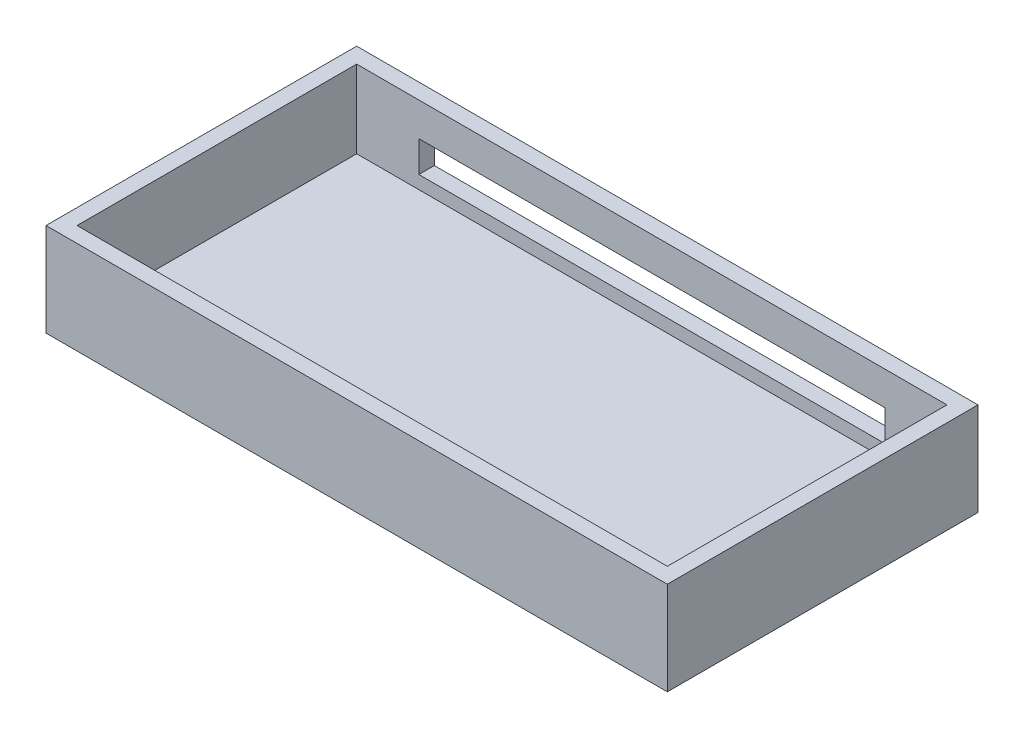
ISO-10303-21;
HEADER;
FILE_DESCRIPTION(('STEP AP214'),'2;1');
FILE_NAME('part.step','',(''),(''),'','','');
FILE_SCHEMA(('AUTOMOTIVE_DESIGN { 1 0 10303 214 1 1 1 1 }'));
ENDSEC;
DATA;
#1=APPLICATION_CONTEXT('core data for automotive mechanical design processes');
#2=APPLICATION_PROTOCOL_DEFINITION('international standard','automotive_design',2000,#1);
#3=PRODUCT_CONTEXT('',#1,'mechanical');
#4=PRODUCT('Part','Part','',(#3));
#5=PRODUCT_RELATED_PRODUCT_CATEGORY('part','',(#4));
#6=PRODUCT_DEFINITION_FORMATION('','',#4);
#7=PRODUCT_DEFINITION_CONTEXT('part definition',#1,'design');
#8=PRODUCT_DEFINITION('design','',#6,#7);
#9=PRODUCT_DEFINITION_SHAPE('','',#8);
#10=(LENGTH_UNIT() NAMED_UNIT(*) SI_UNIT(.MILLI.,.METRE.));
#11=(NAMED_UNIT(*) PLANE_ANGLE_UNIT() SI_UNIT($,.RADIAN.));
#12=(NAMED_UNIT(*) SI_UNIT($,.STERADIAN.) SOLID_ANGLE_UNIT());
#13=UNCERTAINTY_MEASURE_WITH_UNIT(LENGTH_MEASURE(1.E-05),#10,'distance_accuracy_value','');
#14=(GEOMETRIC_REPRESENTATION_CONTEXT(3) GLOBAL_UNCERTAINTY_ASSIGNED_CONTEXT((#13)) GLOBAL_UNIT_ASSIGNED_CONTEXT((#10,
#11,#12)) REPRESENTATION_CONTEXT('',''));
#15=CARTESIAN_POINT('',(0.,0.,0.));
#16=DIRECTION('',(0.,0.,1.));
#17=DIRECTION('',(1.,0.,0.));
#18=AXIS2_PLACEMENT_3D('',#15,#16,#17);
#19=CARTESIAN_POINT('',(100.,30.,-50.));
#20=DIRECTION('',(-1.,0.,0.));
#21=DIRECTION('',(0.,0.,1.));
#22=AXIS2_PLACEMENT_3D('',#19,#20,#21);
#23=PLANE('',#22);
#24=DIRECTION('',(0.,0.,-1.));
#25=VECTOR('',#24,1.);
#26=CARTESIAN_POINT('',(100.,0.,-50.));
#27=LINE('',#26,#25);
#28=CARTESIAN_POINT('',(100.,0.,50.));
#29=VERTEX_POINT('',#28);
#30=CARTESIAN_POINT('',(100.,0.,-50.));
#31=VERTEX_POINT('',#30);
#32=EDGE_CURVE('E169',#29,#31,#27,.T.);
#33=ORIENTED_EDGE('',*,*,#32,.T.);
#34=DIRECTION('',(0.,-1.,0.));
#35=VECTOR('',#34,1.);
#36=CARTESIAN_POINT('',(100.,30.,-50.));
#37=LINE('',#36,#35);
#38=CARTESIAN_POINT('',(100.,30.,-50.));
#39=VERTEX_POINT('',#38);
#40=EDGE_CURVE('E11',#39,#31,#37,.T.);
#41=ORIENTED_EDGE('',*,*,#40,.F.);
#42=DIRECTION('',(0.,0.,-1.));
#43=VECTOR('',#42,1.);
#44=CARTESIAN_POINT('',(100.,30.,-50.));
#45=LINE('',#44,#43);
#46=CARTESIAN_POINT('',(100.,30.,50.));
#47=VERTEX_POINT('',#46);
#48=EDGE_CURVE('E193',#47,#39,#45,.T.);
#49=ORIENTED_EDGE('',*,*,#48,.F.);
#50=DIRECTION('',(0.,-1.,0.));
#51=VECTOR('',#50,1.);
#52=CARTESIAN_POINT('',(100.,30.,50.));
#53=LINE('',#52,#51);
#54=EDGE_CURVE('E203',#47,#29,#53,.T.);
#55=ORIENTED_EDGE('',*,*,#54,.T.);
#56=EDGE_LOOP('',(#33,#41,#49,#55));
#57=FACE_BOUND('',#56,.T.);
#58=ADVANCED_FACE('F37',(#57),#23,.F.);
#59=CARTESIAN_POINT('',(-100.,30.,-50.));
#60=DIRECTION('',(0.,0.,1.));
#61=DIRECTION('',(1.,0.,0.));
#62=AXIS2_PLACEMENT_3D('',#59,#60,#61);
#63=PLANE('',#62);
#64=DIRECTION('',(1.,0.,0.));
#65=VECTOR('',#64,1.);
#66=CARTESIAN_POINT('',(-100.,9.22357402838771,-50.));
#67=LINE('',#66,#65);
#68=CARTESIAN_POINT('',(-75.,9.22357402838771,-50.));
#69=VERTEX_POINT('',#68);
#70=CARTESIAN_POINT('',(75.,9.22357402838771,-50.));
#71=VERTEX_POINT('',#70);
#72=EDGE_CURVE('E156',#69,#71,#67,.T.);
#73=ORIENTED_EDGE('',*,*,#72,.T.);
#74=DIRECTION('',(0.,1.,0.));
#75=VECTOR('',#74,1.);
#76=CARTESIAN_POINT('',(75.,30.,-50.));
#77=LINE('',#76,#75);
#78=CARTESIAN_POINT('',(75.,19.2235740283877,-50.));
#79=VERTEX_POINT('',#78);
#80=EDGE_CURVE('E159',#71,#79,#77,.T.);
#81=ORIENTED_EDGE('',*,*,#80,.T.);
#82=DIRECTION('',(-1.,0.,0.));
#83=VECTOR('',#82,1.);
#84=CARTESIAN_POINT('',(-100.,19.2235740283877,-50.));
#85=LINE('',#84,#83);
#86=CARTESIAN_POINT('',(-75.,19.2235740283877,-50.));
#87=VERTEX_POINT('',#86);
#88=EDGE_CURVE('E151',#79,#87,#85,.T.);
#89=ORIENTED_EDGE('',*,*,#88,.T.);
#90=DIRECTION('',(0.,-1.,0.));
#91=VECTOR('',#90,1.);
#92=CARTESIAN_POINT('',(-75.0000000000001,30.,-50.));
#93=LINE('',#92,#91);
#94=EDGE_CURVE('E131',#87,#69,#93,.T.);
#95=ORIENTED_EDGE('',*,*,#94,.T.);
#96=EDGE_LOOP('',(#73,#81,#89,#95));
#97=FACE_BOUND('',#96,.T.);
#98=DIRECTION('',(-1.,0.,0.));
#99=VECTOR('',#98,1.);
#100=CARTESIAN_POINT('',(-100.,0.,-50.));
#101=LINE('',#100,#99);
#102=CARTESIAN_POINT('',(-100.,0.,-50.));
#103=VERTEX_POINT('',#102);
#104=EDGE_CURVE('E206',#31,#103,#101,.T.);
#105=ORIENTED_EDGE('',*,*,#104,.T.);
#106=DIRECTION('',(0.,-1.,0.));
#107=VECTOR('',#106,1.);
#108=CARTESIAN_POINT('',(-100.,30.,-50.));
#109=LINE('',#108,#107);
#110=CARTESIAN_POINT('',(-100.,30.,-50.));
#111=VERTEX_POINT('',#110);
#112=EDGE_CURVE('E44',#111,#103,#109,.T.);
#113=ORIENTED_EDGE('',*,*,#112,.F.);
#114=DIRECTION('',(-1.,0.,0.));
#115=VECTOR('',#114,1.);
#116=CARTESIAN_POINT('',(-100.,30.,-50.));
#117=LINE('',#116,#115);
#118=EDGE_CURVE('E196',#39,#111,#117,.T.);
#119=ORIENTED_EDGE('',*,*,#118,.F.);
#120=ORIENTED_EDGE('',*,*,#40,.T.);
#121=EDGE_LOOP('',(#105,#113,#119,#120));
#122=FACE_BOUND('',#121,.T.);
#123=ADVANCED_FACE('F236',(#97,#122),#63,.F.);
#124=CARTESIAN_POINT('',(-100.,30.,-50.));
#125=DIRECTION('',(1.,0.,0.));
#126=DIRECTION('',(0.,0.,-1.));
#127=AXIS2_PLACEMENT_3D('',#124,#125,#126);
#128=PLANE('',#127);
#129=DIRECTION('',(0.,0.,1.));
#130=VECTOR('',#129,1.);
#131=CARTESIAN_POINT('',(-100.,0.,-50.));
#132=LINE('',#131,#130);
#133=CARTESIAN_POINT('',(-100.,0.,50.));
#134=VERTEX_POINT('',#133);
#135=EDGE_CURVE('E208',#103,#134,#132,.T.);
#136=ORIENTED_EDGE('',*,*,#135,.T.);
#137=DIRECTION('',(0.,-1.,0.));
#138=VECTOR('',#137,1.);
#139=CARTESIAN_POINT('',(-100.,30.,50.));
#140=LINE('',#139,#138);
#141=CARTESIAN_POINT('',(-100.,30.,50.));
#142=VERTEX_POINT('',#141);
#143=EDGE_CURVE('E213',#142,#134,#140,.T.);
#144=ORIENTED_EDGE('',*,*,#143,.F.);
#145=DIRECTION('',(0.,0.,1.));
#146=VECTOR('',#145,1.);
#147=CARTESIAN_POINT('',(-100.,30.,-50.));
#148=LINE('',#147,#146);
#149=EDGE_CURVE('E199',#111,#142,#148,.T.);
#150=ORIENTED_EDGE('',*,*,#149,.F.);
#151=ORIENTED_EDGE('',*,*,#112,.T.);
#152=EDGE_LOOP('',(#136,#144,#150,#151));
#153=FACE_BOUND('',#152,.T.);
#154=ADVANCED_FACE('F220',(#153),#128,.F.);
#155=CARTESIAN_POINT('',(-100.,30.,50.));
#156=DIRECTION('',(0.,0.,-1.));
#157=DIRECTION('',(-1.,0.,0.));
#158=AXIS2_PLACEMENT_3D('',#155,#156,#157);
#159=PLANE('',#158);
#160=DIRECTION('',(1.,0.,0.));
#161=VECTOR('',#160,1.);
#162=CARTESIAN_POINT('',(-100.,0.,50.));
#163=LINE('',#162,#161);
#164=EDGE_CURVE('E197',#134,#29,#163,.T.);
#165=ORIENTED_EDGE('',*,*,#164,.T.);
#166=ORIENTED_EDGE('',*,*,#54,.F.);
#167=DIRECTION('',(1.,0.,0.));
#168=VECTOR('',#167,1.);
#169=CARTESIAN_POINT('',(-100.,30.,50.));
#170=LINE('',#169,#168);
#171=EDGE_CURVE('E201',#142,#47,#170,.T.);
#172=ORIENTED_EDGE('',*,*,#171,.F.);
#173=ORIENTED_EDGE('',*,*,#143,.T.);
#174=EDGE_LOOP('',(#165,#166,#172,#173));
#175=FACE_BOUND('',#174,.T.);
#176=ADVANCED_FACE('F229',(#175),#159,.F.);
#177=CARTESIAN_POINT('',(0.,30.,0.));
#178=DIRECTION('',(0.,1.,0.));
#179=DIRECTION('',(0.,0.,1.));
#180=AXIS2_PLACEMENT_3D('',#177,#178,#179);
#181=PLANE('',#180);
#182=DIRECTION('',(0.,0.,-1.));
#183=VECTOR('',#182,1.);
#184=CARTESIAN_POINT('',(95.,30.,-50.));
#185=LINE('',#184,#183);
#186=CARTESIAN_POINT('',(95.,30.,45.));
#187=VERTEX_POINT('',#186);
#188=CARTESIAN_POINT('',(95.,30.,-45.));
#189=VERTEX_POINT('',#188);
#190=EDGE_CURVE('E185',#187,#189,#185,.T.);
#191=ORIENTED_EDGE('',*,*,#190,.F.);
#192=DIRECTION('',(1.,0.,0.));
#193=VECTOR('',#192,1.);
#194=CARTESIAN_POINT('',(-100.,30.,45.));
#195=LINE('',#194,#193);
#196=CARTESIAN_POINT('',(-95.,30.,45.));
#197=VERTEX_POINT('',#196);
#198=EDGE_CURVE('E175',#197,#187,#195,.T.);
#199=ORIENTED_EDGE('',*,*,#198,.F.);
#200=DIRECTION('',(0.,0.,1.));
#201=VECTOR('',#200,1.);
#202=CARTESIAN_POINT('',(-95.,30.,-50.));
#203=LINE('',#202,#201);
#204=CARTESIAN_POINT('',(-95.,30.,-45.));
#205=VERTEX_POINT('',#204);
#206=EDGE_CURVE('E189',#205,#197,#203,.T.);
#207=ORIENTED_EDGE('',*,*,#206,.F.);
#208=DIRECTION('',(-1.,0.,0.));
#209=VECTOR('',#208,1.);
#210=CARTESIAN_POINT('',(-100.,30.,-45.));
#211=LINE('',#210,#209);
#212=EDGE_CURVE('E187',#189,#205,#211,.T.);
#213=ORIENTED_EDGE('',*,*,#212,.F.);
#214=EDGE_LOOP('',(#191,#199,#207,#213));
#215=FACE_BOUND('',#214,.T.);
#216=ORIENTED_EDGE('',*,*,#48,.T.);
#217=ORIENTED_EDGE('',*,*,#118,.T.);
#218=ORIENTED_EDGE('',*,*,#149,.T.);
#219=ORIENTED_EDGE('',*,*,#171,.T.);
#220=EDGE_LOOP('',(#216,#217,#218,#219));
#221=FACE_BOUND('',#220,.T.);
#222=ADVANCED_FACE('F235',(#215,#221),#181,.T.);
#223=CARTESIAN_POINT('',(0.,0.,0.));
#224=DIRECTION('',(0.,1.,0.));
#225=DIRECTION('',(0.,0.,1.));
#226=AXIS2_PLACEMENT_3D('',#223,#224,#225);
#227=PLANE('',#226);
#228=ORIENTED_EDGE('',*,*,#32,.F.);
#229=ORIENTED_EDGE('',*,*,#164,.F.);
#230=ORIENTED_EDGE('',*,*,#135,.F.);
#231=ORIENTED_EDGE('',*,*,#104,.F.);
#232=EDGE_LOOP('',(#228,#229,#230,#231));
#233=FACE_BOUND('',#232,.T.);
#234=ADVANCED_FACE('F226',(#233),#227,.F.);
#235=CARTESIAN_POINT('',(95.,30.,-50.));
#236=DIRECTION('',(-1.,0.,0.));
#237=DIRECTION('',(0.,0.,1.));
#238=AXIS2_PLACEMENT_3D('',#235,#236,#237);
#239=PLANE('',#238);
#240=DIRECTION('',(0.,0.,-1.));
#241=VECTOR('',#240,1.);
#242=CARTESIAN_POINT('',(95.,5.,-50.));
#243=LINE('',#242,#241);
#244=CARTESIAN_POINT('',(95.,5.,45.));
#245=VERTEX_POINT('',#244);
#246=CARTESIAN_POINT('',(95.,5.,-45.));
#247=VERTEX_POINT('',#246);
#248=EDGE_CURVE('E162',#245,#247,#243,.T.);
#249=ORIENTED_EDGE('',*,*,#248,.F.);
#250=DIRECTION('',(0.,-1.,0.));
#251=VECTOR('',#250,1.);
#252=CARTESIAN_POINT('',(95.,30.,45.));
#253=LINE('',#252,#251);
#254=EDGE_CURVE('E171',#187,#245,#253,.T.);
#255=ORIENTED_EDGE('',*,*,#254,.F.);
#256=ORIENTED_EDGE('',*,*,#190,.T.);
#257=DIRECTION('',(0.,-1.,0.));
#258=VECTOR('',#257,1.);
#259=CARTESIAN_POINT('',(95.,30.,-45.));
#260=LINE('',#259,#258);
#261=EDGE_CURVE('E166',#189,#247,#260,.T.);
#262=ORIENTED_EDGE('',*,*,#261,.T.);
#263=EDGE_LOOP('',(#249,#255,#256,#262));
#264=FACE_BOUND('',#263,.T.);
#265=ADVANCED_FACE('F249',(#264),#239,.T.);
#266=CARTESIAN_POINT('',(-100.,30.,-45.));
#267=DIRECTION('',(0.,0.,1.));
#268=DIRECTION('',(1.,0.,0.));
#269=AXIS2_PLACEMENT_3D('',#266,#267,#268);
#270=PLANE('',#269);
#271=DIRECTION('',(0.,1.,0.));
#272=VECTOR('',#271,1.);
#273=CARTESIAN_POINT('',(75.,19.2235740283877,-45.));
#274=LINE('',#273,#272);
#275=CARTESIAN_POINT('',(75.,9.22357402838771,-45.));
#276=VERTEX_POINT('',#275);
#277=CARTESIAN_POINT('',(75.,19.2235740283877,-45.));
#278=VERTEX_POINT('',#277);
#279=EDGE_CURVE('E59',#276,#278,#274,.T.);
#280=ORIENTED_EDGE('',*,*,#279,.F.);
#281=DIRECTION('',(1.,0.,0.));
#282=VECTOR('',#281,1.);
#283=CARTESIAN_POINT('',(-75.,9.22357402838771,-45.));
#284=LINE('',#283,#282);
#285=CARTESIAN_POINT('',(-75.,9.22357402838771,-45.));
#286=VERTEX_POINT('',#285);
#287=EDGE_CURVE('E144',#286,#276,#284,.T.);
#288=ORIENTED_EDGE('',*,*,#287,.F.);
#289=DIRECTION('',(0.,-1.,0.));
#290=VECTOR('',#289,1.);
#291=CARTESIAN_POINT('',(-75.,19.2235740283877,-45.));
#292=LINE('',#291,#290);
#293=CARTESIAN_POINT('',(-75.,19.2235740283877,-45.));
#294=VERTEX_POINT('',#293);
#295=EDGE_CURVE('E128',#294,#286,#292,.T.);
#296=ORIENTED_EDGE('',*,*,#295,.F.);
#297=DIRECTION('',(-1.,0.,0.));
#298=VECTOR('',#297,1.);
#299=CARTESIAN_POINT('',(-75.,19.2235740283877,-45.));
#300=LINE('',#299,#298);
#301=EDGE_CURVE('E137',#278,#294,#300,.T.);
#302=ORIENTED_EDGE('',*,*,#301,.F.);
#303=EDGE_LOOP('',(#280,#288,#296,#302));
#304=FACE_BOUND('',#303,.T.);
#305=DIRECTION('',(-1.,0.,0.));
#306=VECTOR('',#305,1.);
#307=CARTESIAN_POINT('',(-100.,5.,-45.));
#308=LINE('',#307,#306);
#309=CARTESIAN_POINT('',(-95.,5.,-45.));
#310=VERTEX_POINT('',#309);
#311=EDGE_CURVE('E165',#247,#310,#308,.T.);
#312=ORIENTED_EDGE('',*,*,#311,.F.);
#313=ORIENTED_EDGE('',*,*,#261,.F.);
#314=ORIENTED_EDGE('',*,*,#212,.T.);
#315=DIRECTION('',(0.,-1.,0.));
#316=VECTOR('',#315,1.);
#317=CARTESIAN_POINT('',(-95.,30.,-45.));
#318=LINE('',#317,#316);
#319=EDGE_CURVE('E170',#205,#310,#318,.T.);
#320=ORIENTED_EDGE('',*,*,#319,.T.);
#321=EDGE_LOOP('',(#312,#313,#314,#320));
#322=FACE_BOUND('',#321,.T.);
#323=ADVANCED_FACE('F141',(#304,#322),#270,.T.);
#324=CARTESIAN_POINT('',(-95.,30.,-50.));
#325=DIRECTION('',(1.,0.,0.));
#326=DIRECTION('',(0.,0.,-1.));
#327=AXIS2_PLACEMENT_3D('',#324,#325,#326);
#328=PLANE('',#327);
#329=DIRECTION('',(0.,0.,1.));
#330=VECTOR('',#329,1.);
#331=CARTESIAN_POINT('',(-95.,5.,-50.));
#332=LINE('',#331,#330);
#333=CARTESIAN_POINT('',(-95.,5.,45.));
#334=VERTEX_POINT('',#333);
#335=EDGE_CURVE('E177',#310,#334,#332,.T.);
#336=ORIENTED_EDGE('',*,*,#335,.F.);
#337=ORIENTED_EDGE('',*,*,#319,.F.);
#338=ORIENTED_EDGE('',*,*,#206,.T.);
#339=DIRECTION('',(0.,-1.,0.));
#340=VECTOR('',#339,1.);
#341=CARTESIAN_POINT('',(-95.,30.,45.));
#342=LINE('',#341,#340);
#343=EDGE_CURVE('E174',#197,#334,#342,.T.);
#344=ORIENTED_EDGE('',*,*,#343,.T.);
#345=EDGE_LOOP('',(#336,#337,#338,#344));
#346=FACE_BOUND('',#345,.T.);
#347=ADVANCED_FACE('F261',(#346),#328,.T.);
#348=CARTESIAN_POINT('',(-100.,30.,45.));
#349=DIRECTION('',(0.,0.,-1.));
#350=DIRECTION('',(-1.,0.,0.));
#351=AXIS2_PLACEMENT_3D('',#348,#349,#350);
#352=PLANE('',#351);
#353=DIRECTION('',(1.,0.,0.));
#354=VECTOR('',#353,1.);
#355=CARTESIAN_POINT('',(-100.,5.,45.));
#356=LINE('',#355,#354);
#357=EDGE_CURVE('E181',#334,#245,#356,.T.);
#358=ORIENTED_EDGE('',*,*,#357,.F.);
#359=ORIENTED_EDGE('',*,*,#343,.F.);
#360=ORIENTED_EDGE('',*,*,#198,.T.);
#361=ORIENTED_EDGE('',*,*,#254,.T.);
#362=EDGE_LOOP('',(#358,#359,#360,#361));
#363=FACE_BOUND('',#362,.T.);
#364=ADVANCED_FACE('F257',(#363),#352,.T.);
#365=CARTESIAN_POINT('',(0.,5.,0.));
#366=DIRECTION('',(0.,1.,0.));
#367=DIRECTION('',(0.,0.,1.));
#368=AXIS2_PLACEMENT_3D('',#365,#366,#367);
#369=PLANE('',#368);
#370=ORIENTED_EDGE('',*,*,#248,.T.);
#371=ORIENTED_EDGE('',*,*,#311,.T.);
#372=ORIENTED_EDGE('',*,*,#335,.T.);
#373=ORIENTED_EDGE('',*,*,#357,.T.);
#374=EDGE_LOOP('',(#370,#371,#372,#373));
#375=FACE_BOUND('',#374,.T.);
#376=ADVANCED_FACE('F253',(#375),#369,.T.);
#377=CARTESIAN_POINT('',(75.,19.2235740283877,-55.));
#378=DIRECTION('',(1.,0.,0.));
#379=DIRECTION('',(0.,0.,-1.));
#380=AXIS2_PLACEMENT_3D('',#377,#378,#379);
#381=PLANE('',#380);
#382=DIRECTION('',(0.,0.,1.));
#383=VECTOR('',#382,1.);
#384=CARTESIAN_POINT('',(75.,9.22357402838771,-55.));
#385=LINE('',#384,#383);
#386=EDGE_CURVE('E149',#71,#276,#385,.T.);
#387=ORIENTED_EDGE('',*,*,#386,.T.);
#388=ORIENTED_EDGE('',*,*,#279,.T.);
#389=DIRECTION('',(0.,0.,1.));
#390=VECTOR('',#389,1.);
#391=CARTESIAN_POINT('',(75.,19.2235740283877,-55.));
#392=LINE('',#391,#390);
#393=EDGE_CURVE('E134',#79,#278,#392,.T.);
#394=ORIENTED_EDGE('',*,*,#393,.F.);
#395=ORIENTED_EDGE('',*,*,#80,.F.);
#396=EDGE_LOOP('',(#387,#388,#394,#395));
#397=FACE_BOUND('',#396,.T.);
#398=ADVANCED_FACE('F256',(#397),#381,.F.);
#399=CARTESIAN_POINT('',(-75.,9.22357402838771,-55.));
#400=DIRECTION('',(0.,-1.,0.));
#401=DIRECTION('',(0.,0.,-1.));
#402=AXIS2_PLACEMENT_3D('',#399,#400,#401);
#403=PLANE('',#402);
#404=DIRECTION('',(0.,0.,1.));
#405=VECTOR('',#404,1.);
#406=CARTESIAN_POINT('',(-75.,9.22357402838771,-55.));
#407=LINE('',#406,#405);
#408=EDGE_CURVE('E133',#69,#286,#407,.T.);
#409=ORIENTED_EDGE('',*,*,#408,.T.);
#410=ORIENTED_EDGE('',*,*,#287,.T.);
#411=ORIENTED_EDGE('',*,*,#386,.F.);
#412=ORIENTED_EDGE('',*,*,#72,.F.);
#413=EDGE_LOOP('',(#409,#410,#411,#412));
#414=FACE_BOUND('',#413,.T.);
#415=ADVANCED_FACE('F273',(#414),#403,.F.);
#416=CARTESIAN_POINT('',(-75.,19.2235740283877,-55.));
#417=DIRECTION('',(-1.,0.,0.));
#418=DIRECTION('',(0.,-1.,0.));
#419=AXIS2_PLACEMENT_3D('',#416,#417,#418);
#420=PLANE('',#419);
#421=DIRECTION('',(0.,0.,1.));
#422=VECTOR('',#421,1.);
#423=CARTESIAN_POINT('',(-75.,19.2235740283877,-55.));
#424=LINE('',#423,#422);
#425=EDGE_CURVE('E51',#87,#294,#424,.T.);
#426=ORIENTED_EDGE('',*,*,#425,.T.);
#427=ORIENTED_EDGE('',*,*,#295,.T.);
#428=ORIENTED_EDGE('',*,*,#408,.F.);
#429=ORIENTED_EDGE('',*,*,#94,.F.);
#430=EDGE_LOOP('',(#426,#427,#428,#429));
#431=FACE_BOUND('',#430,.T.);
#432=ADVANCED_FACE('F125',(#431),#420,.F.);
#433=CARTESIAN_POINT('',(-75.,19.2235740283877,-55.));
#434=DIRECTION('',(0.,1.,0.));
#435=DIRECTION('',(0.,0.,1.));
#436=AXIS2_PLACEMENT_3D('',#433,#434,#435);
#437=PLANE('',#436);
#438=ORIENTED_EDGE('',*,*,#393,.T.);
#439=ORIENTED_EDGE('',*,*,#301,.T.);
#440=ORIENTED_EDGE('',*,*,#425,.F.);
#441=ORIENTED_EDGE('',*,*,#88,.F.);
#442=EDGE_LOOP('',(#438,#439,#440,#441));
#443=FACE_BOUND('',#442,.T.);
#444=ADVANCED_FACE('F138',(#443),#437,.F.);
#445=CLOSED_SHELL('',(#58,#123,#154,#176,#222,#234,#265,#323,#347,#364,#376,#398,#415,#432,#444));
#446=MANIFOLD_SOLID_BREP('B2',#445);
#447=ADVANCED_BREP_SHAPE_REPRESENTATION('',(#18,#446),#14);
#448=SHAPE_DEFINITION_REPRESENTATION(#9,#447);
ENDSEC;
END-ISO-10303-21;
